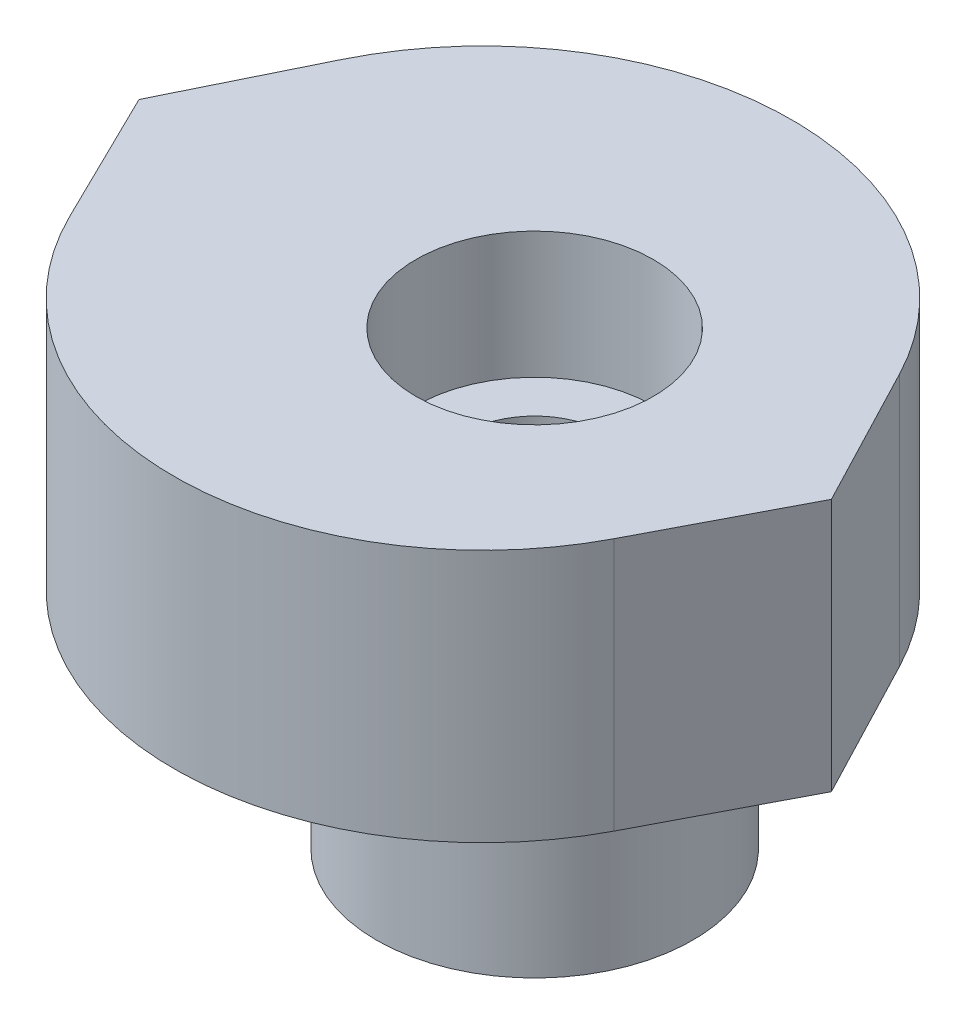
ISO-10303-21;
HEADER;
FILE_DESCRIPTION(('STEP AP214'),'2;1');
FILE_NAME('part.step','',(''),(''),'','','');
FILE_SCHEMA(('AUTOMOTIVE_DESIGN { 1 0 10303 214 1 1 1 1 }'));
ENDSEC;
DATA;
#1=APPLICATION_CONTEXT('core data for automotive mechanical design processes');
#2=APPLICATION_PROTOCOL_DEFINITION('international standard','automotive_design',2000,#1);
#3=PRODUCT_CONTEXT('',#1,'mechanical');
#4=PRODUCT('Part','Part','',(#3));
#5=PRODUCT_RELATED_PRODUCT_CATEGORY('part','',(#4));
#6=PRODUCT_DEFINITION_FORMATION('','',#4);
#7=PRODUCT_DEFINITION_CONTEXT('part definition',#1,'design');
#8=PRODUCT_DEFINITION('design','',#6,#7);
#9=PRODUCT_DEFINITION_SHAPE('','',#8);
#10=(LENGTH_UNIT() NAMED_UNIT(*) SI_UNIT(.MILLI.,.METRE.));
#11=(NAMED_UNIT(*) PLANE_ANGLE_UNIT() SI_UNIT($,.RADIAN.));
#12=(NAMED_UNIT(*) SI_UNIT($,.STERADIAN.) SOLID_ANGLE_UNIT());
#13=UNCERTAINTY_MEASURE_WITH_UNIT(LENGTH_MEASURE(1.E-05),#10,'distance_accuracy_value','');
#14=(GEOMETRIC_REPRESENTATION_CONTEXT(3) GLOBAL_UNCERTAINTY_ASSIGNED_CONTEXT((#13)) GLOBAL_UNIT_ASSIGNED_CONTEXT((#10,
#11,#12)) REPRESENTATION_CONTEXT('',''));
#15=CARTESIAN_POINT('',(0.,0.,0.));
#16=DIRECTION('',(0.,0.,1.));
#17=DIRECTION('',(1.,0.,0.));
#18=AXIS2_PLACEMENT_3D('',#15,#16,#17);
#19=CARTESIAN_POINT('',(-1.30623276071509,0.,0.));
#20=DIRECTION('',(0.,1.,0.));
#21=DIRECTION('',(0.,0.,1.));
#22=AXIS2_PLACEMENT_3D('',#19,#20,#21);
#23=PLANE('',#22);
#24=CARTESIAN_POINT('',(0.,0.,0.));
#25=DIRECTION('',(0.,-1.,0.));
#26=DIRECTION('',(0.,0.,-1.));
#27=AXIS2_PLACEMENT_3D('',#24,#25,#26);
#28=CIRCLE('',#27,5.65);
#29=CARTESIAN_POINT('',(0.,0.,-5.65));
#30=VERTEX_POINT('',#29);
#31=EDGE_CURVE('E198',#30,#30,#28,.T.);
#32=ORIENTED_EDGE('',*,*,#31,.F.);
#33=EDGE_LOOP('',(#32));
#34=FACE_BOUND('',#33,.T.);
#35=DIRECTION('',(0.440176223704268,0.,0.897911405476871));
#36=VECTOR('',#35,1.);
#37=CARTESIAN_POINT('',(-10.,0.,0.));
#38=LINE('',#37,#36);
#39=CARTESIAN_POINT('',(-10.,0.,0.));
#40=VERTEX_POINT('',#39);
#41=CARTESIAN_POINT('',(-8.31553819036838,0.,3.43611805796811));
#42=VERTEX_POINT('',#41);
#43=EDGE_CURVE('E121',#40,#42,#38,.T.);
#44=ORIENTED_EDGE('',*,*,#43,.F.);
#45=DIRECTION('',(-0.440176223704268,0.,0.897911405476871));
#46=VECTOR('',#45,1.);
#47=CARTESIAN_POINT('',(-10.,0.,0.));
#48=LINE('',#47,#46);
#49=CARTESIAN_POINT('',(-8.31553819036838,0.,-3.43611805796811));
#50=VERTEX_POINT('',#49);
#51=EDGE_CURVE('E82',#50,#40,#48,.T.);
#52=ORIENTED_EDGE('',*,*,#51,.F.);
#53=CARTESIAN_POINT('',(-1.30623276071509,0.,0.));
#54=DIRECTION('',(0.,1.,0.));
#55=DIRECTION('',(0.,0.,1.));
#56=AXIS2_PLACEMENT_3D('',#53,#54,#55);
#57=CIRCLE('',#56,7.80623276071509);
#58=CARTESIAN_POINT('',(5.61355593557112,0.,-3.61300350307209));
#59=VERTEX_POINT('',#58);
#60=EDGE_CURVE('E76',#59,#50,#57,.T.);
#61=ORIENTED_EDGE('',*,*,#60,.F.);
#62=DIRECTION('',(-0.462835738290377,0.,-0.886444064428885));
#63=VECTOR('',#62,1.);
#64=CARTESIAN_POINT('',(7.5,0.,0.));
#65=LINE('',#64,#63);
#66=CARTESIAN_POINT('',(7.5,0.,0.));
#67=VERTEX_POINT('',#66);
#68=EDGE_CURVE('E111',#67,#59,#65,.T.);
#69=ORIENTED_EDGE('',*,*,#68,.F.);
#70=DIRECTION('',(0.462835738290376,0.,-0.886444064428886));
#71=VECTOR('',#70,1.);
#72=CARTESIAN_POINT('',(7.5,0.,0.));
#73=LINE('',#72,#71);
#74=CARTESIAN_POINT('',(5.61355593557111,0.,3.61300350307209));
#75=VERTEX_POINT('',#74);
#76=EDGE_CURVE('E126',#75,#67,#73,.T.);
#77=ORIENTED_EDGE('',*,*,#76,.F.);
#78=CARTESIAN_POINT('',(-1.30623276071509,0.,0.));
#79=DIRECTION('',(0.,1.,0.));
#80=DIRECTION('',(0.,0.,1.));
#81=AXIS2_PLACEMENT_3D('',#78,#79,#80);
#82=CIRCLE('',#81,7.80623276071509);
#83=EDGE_CURVE('E124',#42,#75,#82,.T.);
#84=ORIENTED_EDGE('',*,*,#83,.F.);
#85=EDGE_LOOP('',(#44,#52,#61,#69,#77,#84));
#86=FACE_BOUND('',#85,.T.);
#87=ADVANCED_FACE('F35',(#34,#86),#23,.F.);
#88=CARTESIAN_POINT('',(0.,6.4,0.));
#89=DIRECTION('',(0.,-1.,0.));
#90=DIRECTION('',(0.,0.,-1.));
#91=AXIS2_PLACEMENT_3D('',#88,#89,#90);
#92=CYLINDRICAL_SURFACE('',#91,1.8);
#93=CARTESIAN_POINT('',(0.,3.2,0.));
#94=DIRECTION('',(0.,1.,0.));
#95=DIRECTION('',(0.,0.,1.));
#96=AXIS2_PLACEMENT_3D('',#93,#94,#95);
#97=CIRCLE('',#96,1.8);
#98=CARTESIAN_POINT('',(0.,3.2,1.8));
#99=VERTEX_POINT('',#98);
#100=EDGE_CURVE('E39',#99,#99,#97,.T.);
#101=ORIENTED_EDGE('',*,*,#100,.T.);
#102=EDGE_LOOP('',(#101));
#103=FACE_BOUND('',#102,.T.);
#104=CARTESIAN_POINT('',(0.,-5.,0.));
#105=DIRECTION('',(0.,-1.,0.));
#106=DIRECTION('',(0.,0.,-1.));
#107=AXIS2_PLACEMENT_3D('',#104,#105,#106);
#108=CIRCLE('',#107,1.8);
#109=CARTESIAN_POINT('',(0.,-5.,-1.8));
#110=VERTEX_POINT('',#109);
#111=EDGE_CURVE('E197',#110,#110,#108,.T.);
#112=ORIENTED_EDGE('',*,*,#111,.T.);
#113=EDGE_LOOP('',(#112));
#114=FACE_BOUND('',#113,.T.);
#115=ADVANCED_FACE('F158',(#103,#114),#92,.F.);
#116=CARTESIAN_POINT('',(-1.30623276071509,6.4,0.));
#117=DIRECTION('',(0.,1.,0.));
#118=DIRECTION('',(0.,0.,1.));
#119=AXIS2_PLACEMENT_3D('',#116,#117,#118);
#120=PLANE('',#119);
#121=CARTESIAN_POINT('',(0.,6.4,0.));
#122=DIRECTION('',(0.,1.,0.));
#123=DIRECTION('',(0.,0.,1.));
#124=AXIS2_PLACEMENT_3D('',#121,#122,#123);
#125=CIRCLE('',#124,3.);
#126=CARTESIAN_POINT('',(0.,6.4,3.));
#127=VERTEX_POINT('',#126);
#128=EDGE_CURVE('E209',#127,#127,#125,.T.);
#129=ORIENTED_EDGE('',*,*,#128,.F.);
#130=EDGE_LOOP('',(#129));
#131=FACE_BOUND('',#130,.T.);
#132=DIRECTION('',(0.440176223704268,0.,0.897911405476871));
#133=VECTOR('',#132,1.);
#134=CARTESIAN_POINT('',(-10.,6.4,0.));
#135=LINE('',#134,#133);
#136=CARTESIAN_POINT('',(-10.,6.4,0.));
#137=VERTEX_POINT('',#136);
#138=CARTESIAN_POINT('',(-8.31553819036838,6.4,3.43611805796811));
#139=VERTEX_POINT('',#138);
#140=EDGE_CURVE('E131',#137,#139,#135,.T.);
#141=ORIENTED_EDGE('',*,*,#140,.T.);
#142=CARTESIAN_POINT('',(-1.30623276071509,6.4,0.));
#143=DIRECTION('',(0.,1.,0.));
#144=DIRECTION('',(0.,0.,1.));
#145=AXIS2_PLACEMENT_3D('',#142,#143,#144);
#146=CIRCLE('',#145,7.80623276071509);
#147=CARTESIAN_POINT('',(5.61355593557111,6.4,3.61300350307209));
#148=VERTEX_POINT('',#147);
#149=EDGE_CURVE('E90',#139,#148,#146,.T.);
#150=ORIENTED_EDGE('',*,*,#149,.T.);
#151=DIRECTION('',(0.462835738290376,0.,-0.886444064428886));
#152=VECTOR('',#151,1.);
#153=CARTESIAN_POINT('',(7.5,6.4,0.));
#154=LINE('',#153,#152);
#155=CARTESIAN_POINT('',(7.5,6.4,0.));
#156=VERTEX_POINT('',#155);
#157=EDGE_CURVE('E103',#148,#156,#154,.T.);
#158=ORIENTED_EDGE('',*,*,#157,.T.);
#159=DIRECTION('',(-0.462835738290377,0.,-0.886444064428885));
#160=VECTOR('',#159,1.);
#161=CARTESIAN_POINT('',(7.5,6.4,0.));
#162=LINE('',#161,#160);
#163=CARTESIAN_POINT('',(5.61355593557112,6.4,-3.61300350307209));
#164=VERTEX_POINT('',#163);
#165=EDGE_CURVE('E97',#156,#164,#162,.T.);
#166=ORIENTED_EDGE('',*,*,#165,.T.);
#167=CARTESIAN_POINT('',(-1.30623276071509,6.4,0.));
#168=DIRECTION('',(0.,1.,0.));
#169=DIRECTION('',(0.,0.,1.));
#170=AXIS2_PLACEMENT_3D('',#167,#168,#169);
#171=CIRCLE('',#170,7.80623276071509);
#172=CARTESIAN_POINT('',(-8.31553819036838,6.4,-3.43611805796811));
#173=VERTEX_POINT('',#172);
#174=EDGE_CURVE('E101',#164,#173,#171,.T.);
#175=ORIENTED_EDGE('',*,*,#174,.T.);
#176=DIRECTION('',(-0.440176223704268,0.,0.897911405476871));
#177=VECTOR('',#176,1.);
#178=CARTESIAN_POINT('',(-10.,6.4,0.));
#179=LINE('',#178,#177);
#180=EDGE_CURVE('E53',#173,#137,#179,.T.);
#181=ORIENTED_EDGE('',*,*,#180,.T.);
#182=EDGE_LOOP('',(#141,#150,#158,#166,#175,#181));
#183=FACE_BOUND('',#182,.T.);
#184=ADVANCED_FACE('F99',(#131,#183),#120,.T.);
#185=CARTESIAN_POINT('',(-10.,6.4,0.));
#186=DIRECTION('',(0.897911405476871,0.,-0.440176223704268));
#187=DIRECTION('',(-0.440176223704268,0.,-0.897911405476871));
#188=AXIS2_PLACEMENT_3D('',#185,#186,#187);
#189=PLANE('',#188);
#190=ORIENTED_EDGE('',*,*,#43,.T.);
#191=DIRECTION('',(0.,-1.,0.));
#192=VECTOR('',#191,1.);
#193=CARTESIAN_POINT('',(-8.31553819036838,6.4,3.43611805796811));
#194=LINE('',#193,#192);
#195=EDGE_CURVE('E11',#139,#42,#194,.T.);
#196=ORIENTED_EDGE('',*,*,#195,.F.);
#197=ORIENTED_EDGE('',*,*,#140,.F.);
#198=DIRECTION('',(0.,-1.,0.));
#199=VECTOR('',#198,1.);
#200=CARTESIAN_POINT('',(-10.,6.4,0.));
#201=LINE('',#200,#199);
#202=EDGE_CURVE('E117',#137,#40,#201,.T.);
#203=ORIENTED_EDGE('',*,*,#202,.T.);
#204=EDGE_LOOP('',(#190,#196,#197,#203));
#205=FACE_BOUND('',#204,.T.);
#206=ADVANCED_FACE('F37',(#205),#189,.F.);
#207=CARTESIAN_POINT('',(-1.30623276071509,6.4,0.));
#208=DIRECTION('',(0.,-1.,0.));
#209=DIRECTION('',(0.,0.,-1.));
#210=AXIS2_PLACEMENT_3D('',#207,#208,#209);
#211=CYLINDRICAL_SURFACE('',#210,7.80623276071509);
#212=ORIENTED_EDGE('',*,*,#83,.T.);
#213=DIRECTION('',(0.,-1.,0.));
#214=VECTOR('',#213,1.);
#215=CARTESIAN_POINT('',(5.61355593557111,6.4,3.61300350307209));
#216=LINE('',#215,#214);
#217=EDGE_CURVE('E45',#148,#75,#216,.T.);
#218=ORIENTED_EDGE('',*,*,#217,.F.);
#219=ORIENTED_EDGE('',*,*,#149,.F.);
#220=ORIENTED_EDGE('',*,*,#195,.T.);
#221=EDGE_LOOP('',(#212,#218,#219,#220));
#222=FACE_BOUND('',#221,.T.);
#223=ADVANCED_FACE('F285',(#222),#211,.T.);
#224=CARTESIAN_POINT('',(7.5,6.4,0.));
#225=DIRECTION('',(-0.886444064428886,0.,-0.462835738290376));
#226=DIRECTION('',(-0.462835738290376,0.,0.886444064428886));
#227=AXIS2_PLACEMENT_3D('',#224,#225,#226);
#228=PLANE('',#227);
#229=ORIENTED_EDGE('',*,*,#76,.T.);
#230=DIRECTION('',(0.,-1.,0.));
#231=VECTOR('',#230,1.);
#232=CARTESIAN_POINT('',(7.5,6.4,0.));
#233=LINE('',#232,#231);
#234=EDGE_CURVE('E112',#156,#67,#233,.T.);
#235=ORIENTED_EDGE('',*,*,#234,.F.);
#236=ORIENTED_EDGE('',*,*,#157,.F.);
#237=ORIENTED_EDGE('',*,*,#217,.T.);
#238=EDGE_LOOP('',(#229,#235,#236,#237));
#239=FACE_BOUND('',#238,.T.);
#240=ADVANCED_FACE('F138',(#239),#228,.F.);
#241=CARTESIAN_POINT('',(7.5,6.4,0.));
#242=DIRECTION('',(-0.886444064428885,0.,0.462835738290377));
#243=DIRECTION('',(0.462835738290377,0.,0.886444064428886));
#244=AXIS2_PLACEMENT_3D('',#241,#242,#243);
#245=PLANE('',#244);
#246=ORIENTED_EDGE('',*,*,#68,.T.);
#247=DIRECTION('',(0.,-1.,0.));
#248=VECTOR('',#247,1.);
#249=CARTESIAN_POINT('',(5.61355593557112,6.4,-3.61300350307209));
#250=LINE('',#249,#248);
#251=EDGE_CURVE('E108',#164,#59,#250,.T.);
#252=ORIENTED_EDGE('',*,*,#251,.F.);
#253=ORIENTED_EDGE('',*,*,#165,.F.);
#254=ORIENTED_EDGE('',*,*,#234,.T.);
#255=EDGE_LOOP('',(#246,#252,#253,#254));
#256=FACE_BOUND('',#255,.T.);
#257=ADVANCED_FACE('F109',(#256),#245,.F.);
#258=CARTESIAN_POINT('',(-1.30623276071509,6.4,0.));
#259=DIRECTION('',(0.,-1.,0.));
#260=DIRECTION('',(0.,0.,-1.));
#261=AXIS2_PLACEMENT_3D('',#258,#259,#260);
#262=CYLINDRICAL_SURFACE('',#261,7.80623276071509);
#263=ORIENTED_EDGE('',*,*,#60,.T.);
#264=DIRECTION('',(0.,-1.,0.));
#265=VECTOR('',#264,1.);
#266=CARTESIAN_POINT('',(-8.31553819036838,6.4,-3.43611805796811));
#267=LINE('',#266,#265);
#268=EDGE_CURVE('E113',#173,#50,#267,.T.);
#269=ORIENTED_EDGE('',*,*,#268,.F.);
#270=ORIENTED_EDGE('',*,*,#174,.F.);
#271=ORIENTED_EDGE('',*,*,#251,.T.);
#272=EDGE_LOOP('',(#263,#269,#270,#271));
#273=FACE_BOUND('',#272,.T.);
#274=ADVANCED_FACE('F115',(#273),#262,.T.);
#275=CARTESIAN_POINT('',(-10.,6.4,0.));
#276=DIRECTION('',(0.897911405476871,0.,0.440176223704268));
#277=DIRECTION('',(0.440176223704268,0.,-0.897911405476871));
#278=AXIS2_PLACEMENT_3D('',#275,#276,#277);
#279=PLANE('',#278);
#280=ORIENTED_EDGE('',*,*,#51,.T.);
#281=ORIENTED_EDGE('',*,*,#202,.F.);
#282=ORIENTED_EDGE('',*,*,#180,.F.);
#283=ORIENTED_EDGE('',*,*,#268,.T.);
#284=EDGE_LOOP('',(#280,#281,#282,#283));
#285=FACE_BOUND('',#284,.T.);
#286=ADVANCED_FACE('F144',(#285),#279,.F.);
#287=CARTESIAN_POINT('',(0.,3.2,0.));
#288=DIRECTION('',(0.,1.,0.));
#289=DIRECTION('',(0.,0.,1.));
#290=AXIS2_PLACEMENT_3D('',#287,#288,#289);
#291=CYLINDRICAL_SURFACE('',#290,3.);
#292=CARTESIAN_POINT('',(0.,3.2,0.));
#293=DIRECTION('',(0.,1.,0.));
#294=DIRECTION('',(0.,0.,1.));
#295=AXIS2_PLACEMENT_3D('',#292,#293,#294);
#296=CIRCLE('',#295,3.);
#297=CARTESIAN_POINT('',(0.,3.2,3.));
#298=VERTEX_POINT('',#297);
#299=EDGE_CURVE('E210',#298,#298,#296,.T.);
#300=ORIENTED_EDGE('',*,*,#299,.F.);
#301=EDGE_LOOP('',(#300));
#302=FACE_BOUND('',#301,.T.);
#303=ORIENTED_EDGE('',*,*,#128,.T.);
#304=EDGE_LOOP('',(#303));
#305=FACE_BOUND('',#304,.T.);
#306=ADVANCED_FACE('F146',(#302,#305),#291,.F.);
#307=CARTESIAN_POINT('',(0.,3.2,0.));
#308=DIRECTION('',(0.,1.,0.));
#309=DIRECTION('',(0.,0.,1.));
#310=AXIS2_PLACEMENT_3D('',#307,#308,#309);
#311=PLANE('',#310);
#312=ORIENTED_EDGE('',*,*,#100,.F.);
#313=EDGE_LOOP('',(#312));
#314=FACE_BOUND('',#313,.T.);
#315=ORIENTED_EDGE('',*,*,#299,.T.);
#316=EDGE_LOOP('',(#315));
#317=FACE_BOUND('',#316,.T.);
#318=ADVANCED_FACE('F152',(#314,#317),#311,.T.);
#319=CARTESIAN_POINT('',(0.,-5.,0.));
#320=DIRECTION('',(0.,-1.,0.));
#321=DIRECTION('',(0.,0.,-1.));
#322=AXIS2_PLACEMENT_3D('',#319,#320,#321);
#323=PLANE('',#322);
#324=CARTESIAN_POINT('',(0.,-5.,0.));
#325=DIRECTION('',(0.,-1.,0.));
#326=DIRECTION('',(0.,0.,-1.));
#327=AXIS2_PLACEMENT_3D('',#324,#325,#326);
#328=CIRCLE('',#327,4.);
#329=CARTESIAN_POINT('',(0.,-5.,-4.));
#330=VERTEX_POINT('',#329);
#331=EDGE_CURVE('E201',#330,#330,#328,.T.);
#332=ORIENTED_EDGE('',*,*,#331,.T.);
#333=EDGE_LOOP('',(#332));
#334=FACE_BOUND('',#333,.T.);
#335=ORIENTED_EDGE('',*,*,#111,.F.);
#336=EDGE_LOOP('',(#335));
#337=FACE_BOUND('',#336,.T.);
#338=ADVANCED_FACE('F172',(#334,#337),#323,.T.);
#339=CARTESIAN_POINT('',(0.,-5.,0.));
#340=DIRECTION('',(0.,1.,0.));
#341=DIRECTION('',(0.,0.,1.));
#342=AXIS2_PLACEMENT_3D('',#339,#340,#341);
#343=CYLINDRICAL_SURFACE('',#342,4.);
#344=ORIENTED_EDGE('',*,*,#331,.F.);
#345=EDGE_LOOP('',(#344));
#346=FACE_BOUND('',#345,.T.);
#347=CARTESIAN_POINT('',(0.,2.,0.));
#348=DIRECTION('',(0.,-1.,0.));
#349=DIRECTION('',(0.,0.,-1.));
#350=AXIS2_PLACEMENT_3D('',#347,#348,#349);
#351=CIRCLE('',#350,4.);
#352=CARTESIAN_POINT('',(0.,2.,-4.));
#353=VERTEX_POINT('',#352);
#354=EDGE_CURVE('E193',#353,#353,#351,.T.);
#355=ORIENTED_EDGE('',*,*,#354,.T.);
#356=EDGE_LOOP('',(#355));
#357=FACE_BOUND('',#356,.T.);
#358=ADVANCED_FACE('F174',(#346,#357),#343,.T.);
#359=CARTESIAN_POINT('',(0.,2.,0.));
#360=DIRECTION('',(0.,-1.,0.));
#361=DIRECTION('',(0.,0.,-1.));
#362=AXIS2_PLACEMENT_3D('',#359,#360,#361);
#363=CYLINDRICAL_SURFACE('',#362,5.65);
#364=CARTESIAN_POINT('',(0.,2.,0.));
#365=DIRECTION('',(0.,-1.,0.));
#366=DIRECTION('',(0.,0.,-1.));
#367=AXIS2_PLACEMENT_3D('',#364,#365,#366);
#368=CIRCLE('',#367,5.65);
#369=CARTESIAN_POINT('',(0.,2.,-5.65));
#370=VERTEX_POINT('',#369);
#371=EDGE_CURVE('E196',#370,#370,#368,.T.);
#372=ORIENTED_EDGE('',*,*,#371,.F.);
#373=EDGE_LOOP('',(#372));
#374=FACE_BOUND('',#373,.T.);
#375=ORIENTED_EDGE('',*,*,#31,.T.);
#376=EDGE_LOOP('',(#375));
#377=FACE_BOUND('',#376,.T.);
#378=ADVANCED_FACE('F177',(#374,#377),#363,.F.);
#379=CARTESIAN_POINT('',(0.,2.,0.));
#380=DIRECTION('',(0.,-1.,0.));
#381=DIRECTION('',(0.,0.,-1.));
#382=AXIS2_PLACEMENT_3D('',#379,#380,#381);
#383=PLANE('',#382);
#384=ORIENTED_EDGE('',*,*,#354,.F.);
#385=EDGE_LOOP('',(#384));
#386=FACE_BOUND('',#385,.T.);
#387=ORIENTED_EDGE('',*,*,#371,.T.);
#388=EDGE_LOOP('',(#387));
#389=FACE_BOUND('',#388,.T.);
#390=ADVANCED_FACE('F184',(#386,#389),#383,.T.);
#391=CLOSED_SHELL('',(#87,#115,#184,#206,#223,#240,#257,#274,#286,#306,#318,#338,#358,#378,#390));
#392=MANIFOLD_SOLID_BREP('B2',#391);
#393=ADVANCED_BREP_SHAPE_REPRESENTATION('',(#18,#392),#14);
#394=SHAPE_DEFINITION_REPRESENTATION(#9,#393);
ENDSEC;
END-ISO-10303-21;
